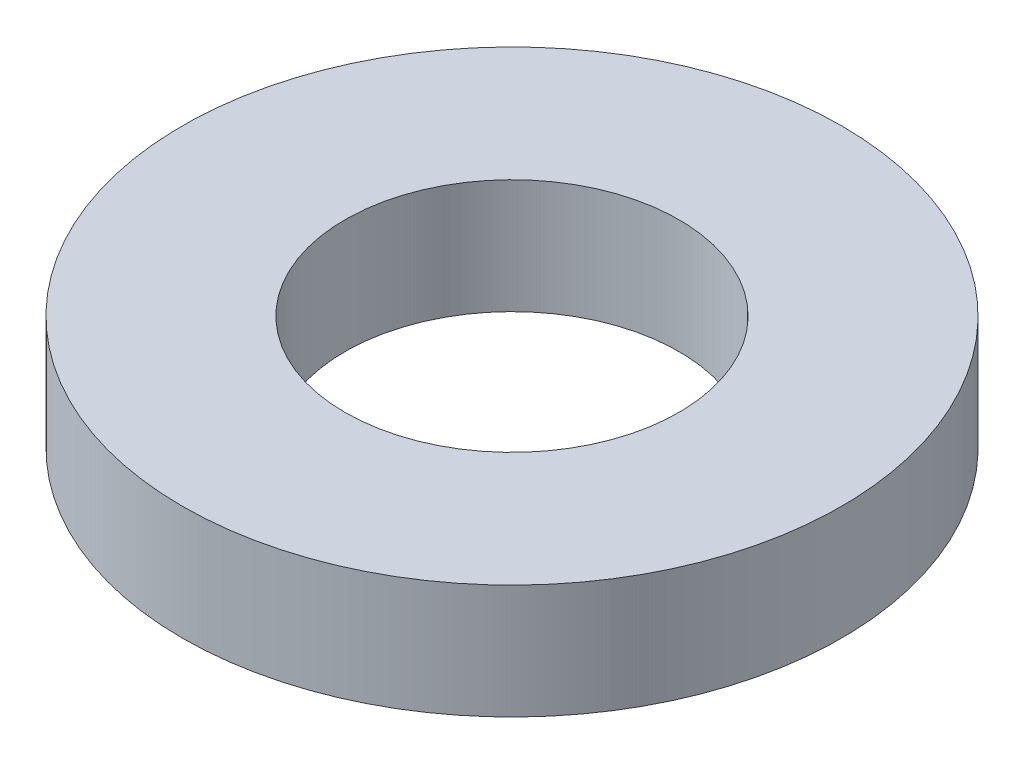
ISO-10303-21;
HEADER;
FILE_DESCRIPTION(('STEP AP214'),'2;1');
FILE_NAME('part.step','',(''),(''),'','','');
FILE_SCHEMA(('AUTOMOTIVE_DESIGN { 1 0 10303 214 1 1 1 1 }'));
ENDSEC;
DATA;
#1=APPLICATION_CONTEXT('core data for automotive mechanical design processes');
#2=APPLICATION_PROTOCOL_DEFINITION('international standard','automotive_design',2000,#1);
#3=PRODUCT_CONTEXT('',#1,'mechanical');
#4=PRODUCT('Part','Part','',(#3));
#5=PRODUCT_RELATED_PRODUCT_CATEGORY('part','',(#4));
#6=PRODUCT_DEFINITION_FORMATION('','',#4);
#7=PRODUCT_DEFINITION_CONTEXT('part definition',#1,'design');
#8=PRODUCT_DEFINITION('design','',#6,#7);
#9=PRODUCT_DEFINITION_SHAPE('','',#8);
#10=(LENGTH_UNIT() NAMED_UNIT(*) SI_UNIT(.MILLI.,.METRE.));
#11=(NAMED_UNIT(*) PLANE_ANGLE_UNIT() SI_UNIT($,.RADIAN.));
#12=(NAMED_UNIT(*) SI_UNIT($,.STERADIAN.) SOLID_ANGLE_UNIT());
#13=UNCERTAINTY_MEASURE_WITH_UNIT(LENGTH_MEASURE(1.E-05),#10,'distance_accuracy_value','');
#14=(GEOMETRIC_REPRESENTATION_CONTEXT(3) GLOBAL_UNCERTAINTY_ASSIGNED_CONTEXT((#13)) GLOBAL_UNIT_ASSIGNED_CONTEXT((#10,
#11,#12)) REPRESENTATION_CONTEXT('',''));
#15=CARTESIAN_POINT('',(0.,0.,0.));
#16=DIRECTION('',(0.,0.,1.));
#17=DIRECTION('',(1.,0.,0.));
#18=AXIS2_PLACEMENT_3D('',#15,#16,#17);
#19=CARTESIAN_POINT('',(0.,1.651,0.));
#20=DIRECTION('',(0.,1.,0.));
#21=DIRECTION('',(0.,0.,1.));
#22=AXIS2_PLACEMENT_3D('',#19,#20,#21);
#23=PLANE('',#22);
#24=CARTESIAN_POINT('',(0.,1.651,0.));
#25=DIRECTION('',(0.,1.,0.));
#26=DIRECTION('',(0.,0.,1.));
#27=AXIS2_PLACEMENT_3D('',#24,#25,#26);
#28=CIRCLE('',#27,4.7625);
#29=CARTESIAN_POINT('',(0.,1.651,4.7625));
#30=VERTEX_POINT('',#29);
#31=EDGE_CURVE('E10',#30,#30,#28,.T.);
#32=ORIENTED_EDGE('',*,*,#31,.T.);
#33=EDGE_LOOP('',(#32));
#34=FACE_BOUND('',#33,.T.);
#35=CARTESIAN_POINT('',(0.,1.651,0.));
#36=DIRECTION('',(0.,1.,0.));
#37=DIRECTION('',(0.,0.,1.));
#38=AXIS2_PLACEMENT_3D('',#35,#36,#37);
#39=CIRCLE('',#38,2.413);
#40=CARTESIAN_POINT('',(0.,1.651,2.413));
#41=VERTEX_POINT('',#40);
#42=EDGE_CURVE('E42',#41,#41,#39,.T.);
#43=ORIENTED_EDGE('',*,*,#42,.F.);
#44=EDGE_LOOP('',(#43));
#45=FACE_BOUND('',#44,.T.);
#46=ADVANCED_FACE('F31',(#34,#45),#23,.T.);
#47=CARTESIAN_POINT('',(0.,0.,0.));
#48=DIRECTION('',(0.,1.,0.));
#49=DIRECTION('',(0.,0.,1.));
#50=AXIS2_PLACEMENT_3D('',#47,#48,#49);
#51=PLANE('',#50);
#52=CARTESIAN_POINT('',(0.,0.,0.));
#53=DIRECTION('',(0.,1.,0.));
#54=DIRECTION('',(0.,0.,1.));
#55=AXIS2_PLACEMENT_3D('',#52,#53,#54);
#56=CIRCLE('',#55,4.7625);
#57=CARTESIAN_POINT('',(0.,0.,4.7625));
#58=VERTEX_POINT('',#57);
#59=EDGE_CURVE('E35',#58,#58,#56,.T.);
#60=ORIENTED_EDGE('',*,*,#59,.F.);
#61=EDGE_LOOP('',(#60));
#62=FACE_BOUND('',#61,.T.);
#63=CARTESIAN_POINT('',(0.,0.,0.));
#64=DIRECTION('',(0.,1.,0.));
#65=DIRECTION('',(0.,0.,1.));
#66=AXIS2_PLACEMENT_3D('',#63,#64,#65);
#67=CIRCLE('',#66,2.413);
#68=CARTESIAN_POINT('',(0.,0.,2.413));
#69=VERTEX_POINT('',#68);
#70=EDGE_CURVE('E44',#69,#69,#67,.T.);
#71=ORIENTED_EDGE('',*,*,#70,.T.);
#72=EDGE_LOOP('',(#71));
#73=FACE_BOUND('',#72,.T.);
#74=ADVANCED_FACE('F54',(#62,#73),#51,.F.);
#75=CARTESIAN_POINT('',(0.,1.651,0.));
#76=DIRECTION('',(0.,-1.,0.));
#77=DIRECTION('',(0.,0.,-1.));
#78=AXIS2_PLACEMENT_3D('',#75,#76,#77);
#79=CYLINDRICAL_SURFACE('',#78,4.7625);
#80=ORIENTED_EDGE('',*,*,#31,.F.);
#81=EDGE_LOOP('',(#80));
#82=FACE_BOUND('',#81,.T.);
#83=ORIENTED_EDGE('',*,*,#59,.T.);
#84=EDGE_LOOP('',(#83));
#85=FACE_BOUND('',#84,.T.);
#86=ADVANCED_FACE('F33',(#82,#85),#79,.T.);
#87=CARTESIAN_POINT('',(0.,1.651,0.));
#88=DIRECTION('',(0.,-1.,0.));
#89=DIRECTION('',(0.,0.,-1.));
#90=AXIS2_PLACEMENT_3D('',#87,#88,#89);
#91=CYLINDRICAL_SURFACE('',#90,2.413);
#92=ORIENTED_EDGE('',*,*,#42,.T.);
#93=EDGE_LOOP('',(#92));
#94=FACE_BOUND('',#93,.T.);
#95=ORIENTED_EDGE('',*,*,#70,.F.);
#96=EDGE_LOOP('',(#95));
#97=FACE_BOUND('',#96,.T.);
#98=ADVANCED_FACE('F50',(#94,#97),#91,.F.);
#99=CLOSED_SHELL('',(#46,#74,#86,#98));
#100=MANIFOLD_SOLID_BREP('B2',#99);
#101=ADVANCED_BREP_SHAPE_REPRESENTATION('',(#18,#100),#14);
#102=SHAPE_DEFINITION_REPRESENTATION(#9,#101);
ENDSEC;
END-ISO-10303-21;
